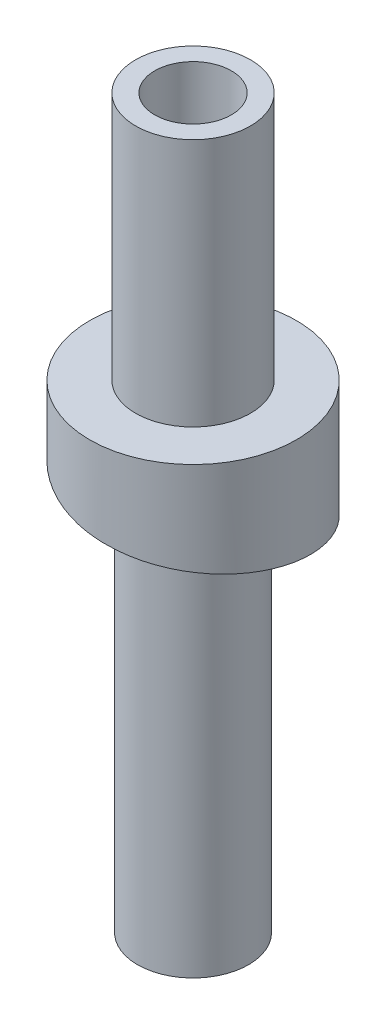
ISO-10303-21;
HEADER;
FILE_DESCRIPTION(('STEP AP214'),'2;1');
FILE_NAME('part.step','',(''),(''),'','','');
FILE_SCHEMA(('AUTOMOTIVE_DESIGN { 1 0 10303 214 1 1 1 1 }'));
ENDSEC;
DATA;
#1=APPLICATION_CONTEXT('core data for automotive mechanical design processes');
#2=APPLICATION_PROTOCOL_DEFINITION('international standard','automotive_design',2000,#1);
#3=PRODUCT_CONTEXT('',#1,'mechanical');
#4=PRODUCT('Part','Part','',(#3));
#5=PRODUCT_RELATED_PRODUCT_CATEGORY('part','',(#4));
#6=PRODUCT_DEFINITION_FORMATION('','',#4);
#7=PRODUCT_DEFINITION_CONTEXT('part definition',#1,'design');
#8=PRODUCT_DEFINITION('design','',#6,#7);
#9=PRODUCT_DEFINITION_SHAPE('','',#8);
#10=(LENGTH_UNIT() NAMED_UNIT(*) SI_UNIT(.MILLI.,.METRE.));
#11=(NAMED_UNIT(*) PLANE_ANGLE_UNIT() SI_UNIT($,.RADIAN.));
#12=(NAMED_UNIT(*) SI_UNIT($,.STERADIAN.) SOLID_ANGLE_UNIT());
#13=UNCERTAINTY_MEASURE_WITH_UNIT(LENGTH_MEASURE(1.E-05),#10,'distance_accuracy_value','');
#14=(GEOMETRIC_REPRESENTATION_CONTEXT(3) GLOBAL_UNCERTAINTY_ASSIGNED_CONTEXT((#13)) GLOBAL_UNIT_ASSIGNED_CONTEXT((#10,
#11,#12)) REPRESENTATION_CONTEXT('',''));
#15=CARTESIAN_POINT('',(0.,0.,0.));
#16=DIRECTION('',(0.,0.,1.));
#17=DIRECTION('',(1.,0.,0.));
#18=AXIS2_PLACEMENT_3D('',#15,#16,#17);
#19=CARTESIAN_POINT('',(0.,-15.,0.));
#20=DIRECTION('',(0.,1.,0.));
#21=DIRECTION('',(0.,0.,1.));
#22=AXIS2_PLACEMENT_3D('',#19,#20,#21);
#23=CYLINDRICAL_SURFACE('',#22,5.4);
#24=CARTESIAN_POINT('',(-5.3999999996698,0.999399656294112,-5.97172927971695E-05));
#25=CARTESIAN_POINT('',(-5.4000178265633,0.977174880598727,0.151209153566943));
#26=CARTESIAN_POINT('',(-5.39364798262599,0.954902395951935,0.30247096272042));
#27=CARTESIAN_POINT('',(-5.36825059865979,0.910318758196815,0.603916884615939));
#28=CARTESIAN_POINT('',(-5.34922354242759,0.888007606598963,0.75410103832744));
#29=CARTESIAN_POINT('',(-5.29863118682716,0.843403285011911,1.05232904959454));
#30=CARTESIAN_POINT('',(-5.26706679158125,0.821110113842201,1.2003730606875));
#31=CARTESIAN_POINT('',(-5.19161572368665,0.776594936032765,1.49331586811294));
#32=CARTESIAN_POINT('',(-5.14772922756754,0.754372928378146,1.6382147094719));
#33=CARTESIAN_POINT('',(-5.07290549269013,0.721163550072862,1.85239165138986));
#34=CARTESIAN_POINT('',(-5.04646341472458,0.71011371131382,1.92325951998803));
#35=CARTESIAN_POINT('',(-4.9906260729381,0.688059986822164,2.0638239525372));
#36=CARTESIAN_POINT('',(-4.96123100119192,0.677056098149198,2.13352059232592));
#37=CARTESIAN_POINT('',(-4.86869868174248,0.643916524194166,2.34064870091816));
#38=CARTESIAN_POINT('',(-4.80120563163447,0.621649153954608,2.47614324490382));
#39=CARTESIAN_POINT('',(-4.65510982056123,0.576964057495631,2.74095346384578));
#40=CARTESIAN_POINT('',(-4.57650716432326,0.55454633269546,2.87026919703267));
#41=CARTESIAN_POINT('',(-4.40873273585271,0.509649801227048,3.1218476189417));
#42=CARTESIAN_POINT('',(-4.31956095871279,0.48717099453045,3.24411030438901));
#43=CARTESIAN_POINT('',(-4.13126828516315,0.442284056013888,3.48073059267735));
#44=CARTESIAN_POINT('',(-4.03214737758371,0.419875924273298,3.59508818664323));
#45=CARTESIAN_POINT('',(-3.82463505027185,0.375281551232411,3.81510546010851));
#46=CARTESIAN_POINT('',(-3.7162436314366,0.35309530991064,3.92076514044967));
#47=CARTESIAN_POINT('',(-3.49098667727326,0.308632112503799,4.12260674435207));
#48=CARTESIAN_POINT('',(-3.37412113710374,0.286355156366908,4.21878866249839));
#49=CARTESIAN_POINT('',(-3.13273011409719,0.24180122021004,4.40100755289137));
#50=CARTESIAN_POINT('',(-3.00820462501768,0.219524240190059,4.48704451687022));
#51=CARTESIAN_POINT('',(-2.75237747072786,0.174974799384202,4.64836428176492));
#52=CARTESIAN_POINT('',(-2.62107580210514,0.152702338600607,4.72364707726498));
#53=CARTESIAN_POINT('',(-2.35259029823634,0.108228652265236,4.86293967312713));
#54=CARTESIAN_POINT('',(-2.21540646957201,0.086027426633782,4.92694948610251));
#55=CARTESIAN_POINT('',(-2.00599471370272,0.0527553630813829,5.01415088863303));
#56=CARTESIAN_POINT('',(-1.93557583178235,0.0416682641978849,5.04175201367388));
#57=CARTESIAN_POINT('',(-1.79365271458233,0.0194471748759414,5.09396968973677));
#58=CARTESIAN_POINT('',(-1.72214854931399,0.00831318749545727,5.11858643236739));
#59=CARTESIAN_POINT('',(-1.50618430723322,-0.0251250411916359,5.18789549355645));
#60=CARTESIAN_POINT('',(-1.36024694804092,-0.0474695945053216,5.22805727498569));
#61=CARTESIAN_POINT('',(-1.06554888430383,-0.0921971667774313,5.29598731725628));
#62=CARTESIAN_POINT('',(-0.916788216276869,-0.114580185234931,5.32375573828461));
#63=CARTESIAN_POINT('',(-0.61742864177302,-0.159312175059446,5.36671565600503));
#64=CARTESIAN_POINT('',(-0.466829698605207,-0.18166114573684,5.38190690124592));
#65=CARTESIAN_POINT('',(-0.24038624985808,-0.215081616971216,5.39517742403418));
#66=CARTESIAN_POINT('',(-0.164800307356206,-0.226206646848385,5.39801452009858));
#67=CARTESIAN_POINT('',(-0.0135931064530676,-0.248405492961114,5.40051203637954));
#68=CARTESIAN_POINT('',(0.0620281328402532,-0.259479324481026,5.40017347537621));
#69=CARTESIAN_POINT('',(0.288780116418368,-0.292763202031905,5.39439189011458));
#70=CARTESIAN_POINT('',(0.439807459179115,-0.315036842625113,5.38418345079553));
#71=CARTESIAN_POINT('',(0.740446606290323,-0.359639375373229,5.35113211704245));
#72=CARTESIAN_POINT('',(0.890058398208488,-0.381968268011229,5.32828911174796));
#73=CARTESIAN_POINT('',(1.18683785667422,-0.426638962847754,5.2701306736067));
#74=CARTESIAN_POINT('',(1.33400557354202,-0.448980764770671,5.23481549787933));
#75=CARTESIAN_POINT('',(1.62486751822482,-0.49360685215823,5.15195830474442));
#76=CARTESIAN_POINT('',(1.76856170416522,-0.515891136926594,5.10441614001671));
#77=CARTESIAN_POINT('',(2.05147327328545,-0.560311172543896,4.9974318479477));
#78=CARTESIAN_POINT('',(2.19069066035812,-0.582446923521979,4.93798973095448));
#79=CARTESIAN_POINT('',(2.46362390046559,-0.626893277562989,4.80764293034048));
#80=CARTESIAN_POINT('',(2.59733975975406,-0.649203880427123,4.73673825974982));
#81=CARTESIAN_POINT('',(2.85834145335515,-0.693868908275784,4.58396678338083));
#82=CARTESIAN_POINT('',(2.98562727768633,-0.71622333332828,4.50209996058652));
#83=CARTESIAN_POINT('',(3.23289611734722,-0.760929423847303,4.32796044608238));
#84=CARTESIAN_POINT('',(3.35287913338946,-0.783281089314098,4.23568775538785));
#85=CARTESIAN_POINT('',(3.52670818536571,-0.816738479300261,4.08999418983344));
#86=CARTESIAN_POINT('',(3.58363272098873,-0.827880446703786,4.04020986128661));
#87=CARTESIAN_POINT('',(3.69534943179368,-0.850121333308605,3.9382874169927));
#88=CARTESIAN_POINT('',(3.75014160644302,-0.861220252499146,3.88614930065773));
#89=CARTESIAN_POINT('',(3.85748943695835,-0.883400051975492,3.77961549533459));
#90=CARTESIAN_POINT('',(3.91004508950019,-0.894480932234462,3.72521980299123));
#91=CARTESIAN_POINT('',(4.01281835834331,-0.916688765831424,3.61427846234613));
#92=CARTESIAN_POINT('',(4.06303597534979,-0.927815719155517,3.55773281469287));
#93=CARTESIAN_POINT('',(4.21005277998158,-0.961228036054723,3.38501181881088));
#94=CARTESIAN_POINT('',(4.30323899226335,-0.983549609751789,3.26572951580854));
#95=CARTESIAN_POINT('',(4.47925604270588,-1.02822734700231,3.01979201869376));
#96=CARTESIAN_POINT('',(4.56208690229309,-1.05058351048409,2.89313683983748));
#97=CARTESIAN_POINT('',(4.71684250949853,-1.0952659819431,2.63329681768933));
#98=CARTESIAN_POINT('',(4.78876726959834,-1.11759228995447,2.50011198187061));
#99=CARTESIAN_POINT('',(4.88807424528647,-1.15098941062395,2.29618247074829));
#100=CARTESIAN_POINT('',(4.91974997215547,-1.1621077804496,2.22750506402456));
#101=CARTESIAN_POINT('',(4.98019091192907,-1.18429630481602,2.08887889616817));
#102=CARTESIAN_POINT('',(5.00895631404504,-1.19536646244641,2.01893021803499));
#103=CARTESIAN_POINT('',(5.09080154192666,-1.22864085424066,1.8073731892616));
#104=CARTESIAN_POINT('',(5.13944254511364,-1.25091303495146,1.66402887339639));
#105=CARTESIAN_POINT('',(5.22451615494095,-1.29552411776778,1.37379272497594));
#106=CARTESIAN_POINT('',(5.26094878421978,-1.31786301974949,1.22690089899956));
#107=CARTESIAN_POINT('',(5.32136164924338,-1.36255806902657,0.930575842431477));
#108=CARTESIAN_POINT('',(5.34534188258628,-1.38491421632527,0.781142611349594));
#109=CARTESIAN_POINT('',(5.38067983209711,-1.42957039391223,0.480783763740677));
#110=CARTESIAN_POINT('',(5.39203752662502,-1.45187042410422,0.329858144655548));
#111=CARTESIAN_POINT('',(5.40204654371675,-1.49630759316585,0.0275618931040903));
#112=CARTESIAN_POINT('',(5.40069787850004,-1.51844473219212,-0.123808738934139));
#113=CARTESIAN_POINT('',(5.38530439727206,-1.56288825847511,-0.42587745066101));
#114=CARTESIAN_POINT('',(5.37125959293327,-1.58519464557621,-0.57657553096785));
#115=CARTESIAN_POINT('',(5.33057564746259,-1.62985046209607,-0.876257042844943));
#116=CARTESIAN_POINT('',(5.30393648647819,-1.65219989158262,-1.02524047171201));
#117=CARTESIAN_POINT('',(5.23825370704394,-1.69689941002416,-1.3204419287004));
#118=CARTESIAN_POINT('',(5.19921009038711,-1.71924949897906,-1.46665995722145));
#119=CARTESIAN_POINT('',(5.10897802564143,-1.76384722768906,-1.75533597157626));
#120=CARTESIAN_POINT('',(5.05778959827772,-1.78609486761893,-1.89779396382607));
#121=CARTESIAN_POINT('',(4.97218611466268,-1.81936818000581,-2.10786357896696));
#122=CARTESIAN_POINT('',(4.94217718636069,-1.83044430159668,-2.17729232248492));
#123=CARTESIAN_POINT('',(4.87927629439493,-1.85264601633976,-2.31481759662624));
#124=CARTESIAN_POINT('',(4.84638451606671,-1.86377160626811,-2.38291421254696));
#125=CARTESIAN_POINT('',(4.74346268388456,-1.89718029855729,-2.5850364117898));
#126=CARTESIAN_POINT('',(4.669175689953,-1.91949936792724,-2.71691996369978));
#127=CARTESIAN_POINT('',(4.50981492986262,-1.96417451057228,-2.97396144440029));
#128=CARTESIAN_POINT('',(4.42474130017414,-1.98653058337568,-3.09911945825244));
#129=CARTESIAN_POINT('',(4.24437172319027,-2.03121468341123,-3.3418804165956));
#130=CARTESIAN_POINT('',(4.14907557113325,-2.05354271007256,-3.45948320967671));
#131=CARTESIAN_POINT('',(3.99899383505381,-2.08694769105999,-3.62956932633709));
#132=CARTESIAN_POINT('',(3.94776693104325,-2.0980702116176,-3.68522133615174));
#133=CARTESIAN_POINT('',(3.84303310379909,-2.12026194853953,-3.79431306233925));
#134=CARTESIAN_POINT('',(3.78952691730694,-2.13133118085996,-3.84775348272561));
#135=CARTESIAN_POINT('',(3.62570440662807,-2.16460486793246,-4.00463802328515));
#136=CARTESIAN_POINT('',(3.51207859131076,-2.18687652703594,-4.10465169946512));
#137=CARTESIAN_POINT('',(3.27685769130527,-2.23149118089353,-4.2947735279359));
#138=CARTESIAN_POINT('',(3.15526253884915,-2.25383417625271,-4.38488159597606));
#139=CARTESIAN_POINT('',(2.90494114817733,-2.29853704720246,-4.55457763106353));
#140=CARTESIAN_POINT('',(2.77621505628556,-2.32089692243738,-4.63416581386114));
#141=CARTESIAN_POINT('',(2.51253123787613,-2.36556225641265,-4.7822646476277));
#142=CARTESIAN_POINT('',(2.37757343562233,-2.38786771448818,-4.85077516392034));
#143=CARTESIAN_POINT('',(2.10236052238183,-2.43230583395117,-4.9762382039842));
#144=CARTESIAN_POINT('',(1.96210541671941,-2.45443849551228,-5.03319073937191));
#145=CARTESIAN_POINT('',(1.6773332056941,-2.4988625846576,-5.13511720805373));
#146=CARTESIAN_POINT('',(1.5328161032152,-2.52115401213438,-5.18009114945327));
#147=CARTESIAN_POINT('',(1.24052264536529,-2.56578061882385,-5.25775308131304));
#148=CARTESIAN_POINT('',(1.09274628502929,-2.58811579810314,-5.29044105305606));
#149=CARTESIAN_POINT('',(0.794977789833262,-2.63279023616514,-5.34330230557272));
#150=CARTESIAN_POINT('',(0.644985655672946,-2.65512949494657,-5.36347559029825));
#151=CARTESIAN_POINT('',(0.3438055675547,-2.69972200112572,-5.39116489264816));
#152=CARTESIAN_POINT('',(0.192617615539742,-2.7219752486631,-5.39868093083386));
#153=CARTESIAN_POINT('',(-0.0342158862432015,-2.75525955155555,-5.40042153547064));
#154=CARTESIAN_POINT('',(-0.10984507398113,-2.76633976549836,-5.39941210837226));
#155=CARTESIAN_POINT('',(-0.260981632808378,-2.7885525747553,-5.3942196971673));
#156=CARTESIAN_POINT('',(-0.336489011411347,-2.7996851666586,-5.39003691694137));
#157=CARTESIAN_POINT('',(-0.56264206882186,-2.83311942966856,-5.37273530254587));
#158=CARTESIAN_POINT('',(-0.712946339686217,-2.85546163456564,-5.35486340333707));
#159=CARTESIAN_POINT('',(-1.01149276598297,-2.90018770657342,-5.3065769201163));
#160=CARTESIAN_POINT('',(-1.15973494781799,-2.92257157314652,-5.27616249684964));
#161=CARTESIAN_POINT('',(-1.45317596678746,-2.96730659893997,-5.20299283895735));
#162=CARTESIAN_POINT('',(-1.59837474285935,-2.98965775749572,-5.16023735697585));
#163=CARTESIAN_POINT('',(-1.81308576505567,-3.02309070509243,-5.08708609666182));
#164=CARTESIAN_POINT('',(-1.88415439209606,-3.03422143146982,-5.06119373485494));
#165=CARTESIAN_POINT('',(-2.02512653653212,-3.05642600903295,-5.00645358823305));
#166=CARTESIAN_POINT('',(-2.09503042035921,-3.06749987731778,-4.97760675412426));
#167=CARTESIAN_POINT('',(-2.30284381295086,-3.10075669738933,-4.88669301214447));
#168=CARTESIAN_POINT('',(-2.43886305541148,-3.122976093146,-4.82025014042789));
#169=CARTESIAN_POINT('',(-2.70482454661856,-3.16745619742481,-4.67619539739648));
#170=CARTESIAN_POINT('',(-2.83476673620204,-3.18971690634697,-4.5985834173751));
#171=CARTESIAN_POINT('',(-3.08767935232394,-3.23426087223701,-4.43273056945183));
#172=CARTESIAN_POINT('',(-3.2106499217669,-3.25654412873318,-4.34448991953276));
#173=CARTESIAN_POINT('',(-3.44875422423941,-3.30110415316672,-4.15800009341119));
#174=CARTESIAN_POINT('',(-3.56388785918166,-3.32338092101939,-4.05975079197855));
#175=CARTESIAN_POINT('',(-3.78551131662821,-3.36785792138323,-3.85392924675164));
#176=CARTESIAN_POINT('',(-3.89200117924987,-3.39005815424914,-3.74635704623149));
#177=CARTESIAN_POINT('',(-4.09555771700039,-3.43467527583744,-3.52268022694963));
#178=CARTESIAN_POINT('',(-4.1926244640092,-3.45709216290574,-3.40657567328498));
#179=CARTESIAN_POINT('',(-4.37667008798019,-3.50197764999186,-3.16664202290592));
#180=CARTESIAN_POINT('',(-4.4636488048156,-3.52444625082475,-3.04281280362627));
#181=CARTESIAN_POINT('',(-4.62692405226373,-3.56933725467068,-2.78826643866311));
#182=CARTESIAN_POINT('',(-4.7032203861457,-3.59175965682541,-2.65754916618764));
#183=CARTESIAN_POINT('',(-4.80922852067601,-3.625248177439,-2.45703958535307));
#184=CARTESIAN_POINT('',(-4.84316093922107,-3.63638774406675,-2.38945839355842));
#185=CARTESIAN_POINT('',(-4.90816488711454,-3.65859515511169,-2.25291649745004));
#186=CARTESIAN_POINT('',(-4.93923640416109,-3.66966299922028,-2.18395578720592));
#187=CARTESIAN_POINT('',(-4.99845574764461,-3.69173073934433,-2.04478808018313));
#188=CARTESIAN_POINT('',(-5.02660385051284,-3.70273064169153,-1.97458120197561));
#189=CARTESIAN_POINT('',(-5.07992255326128,-3.72478993262735,-1.83305901868134));
#190=CARTESIAN_POINT('',(-5.10509320227857,-3.73584932023113,-1.7617437319087));
#191=CARTESIAN_POINT('',(-5.17608029696566,-3.76907041215848,-1.54630513551969));
#192=CARTESIAN_POINT('',(-5.21737500340102,-3.79127620049047,-1.40068177011272));
#193=CARTESIAN_POINT('',(-5.30139986763135,-3.84454046807698,-1.04858070854727));
#194=CARTESIAN_POINT('',(-5.33831286434336,-3.87564745931957,-0.840684463151389));
#195=CARTESIAN_POINT('',(-5.37529247344344,-3.92230673056301,-0.52667513971064));
#196=CARTESIAN_POINT('',(-5.38455405847756,-3.93787203308347,-0.421559831101073));
#197=CARTESIAN_POINT('',(-5.39690692962542,-3.96896780702359,-0.21097393413955));
#198=CARTESIAN_POINT('',(-5.3999988929973,-3.98449828207941,-0.105503386056668));
#199=CARTESIAN_POINT('',(-5.4,-3.99999999999999,0.));
#200=B_SPLINE_CURVE_WITH_KNOTS('',3,(#24,#25,#26,#27,#28,#29,#30,#31,#32,#33,#34,#35,#36,#37,
#38,#39,#40,#41,#42,#43,#44,#45,#46,#47,#48,#49,#50,#51,#52,#53,#54,#55,#56,#57,#58,#59,#60,#61,
#62,#63,#64,#65,#66,#67,#68,#69,#70,#71,#72,#73,#74,#75,#76,#77,#78,#79,#80,#81,#82,#83,#84,#85,
#86,#87,#88,#89,#90,#91,#92,#93,#94,#95,#96,#97,#98,#99,#100,#101,#102,#103,#104,#105,#106,#107,
#108,#109,#110,#111,#112,#113,#114,#115,#116,#117,#118,#119,#120,#121,#122,#123,#124,#125,#126,
#127,#128,#129,#130,#131,#132,#133,#134,#135,#136,#137,#138,#139,#140,#141,#142,#143,#144,#145,
#146,#147,#148,#149,#150,#151,#152,#153,#154,#155,#156,#157,#158,#159,#160,#161,#162,#163,#164,
#165,#166,#167,#168,#169,#170,#171,#172,#173,#174,#175,#176,#177,#178,#179,#180,#181,#182,#183,
#184,#185,#186,#187,#188,#189,#190,#191,#192,#193,#194,#195,#196,#197,#198,#199),.UNSPECIFIED.,
.F.,.F.,(4,2,2,2,2,2,2,2,2,2,2,2,2,2,2,2,2,2,2,2,2,2,2,2,2,2,2,2,2,2,2,2,2,2,2,2,2,2,2,2,2,2,2,
2,2,2,2,2,2,2,2,2,2,2,2,2,2,2,2,2,2,2,2,2,2,2,2,2,2,2,2,2,2,2,2,2,2,2,2,2,2,2,2,2,2,2,2,4),(0.,
0.458546890683472,0.917076255333475,1.3755725594285,1.83406229532291,2.06333435367815,
2.29259150888757,2.75102617466047,3.2094565191824,3.6678870765589,4.12631814861377,
4.58474917630283,5.04318046590514,5.50161212911132,5.96004402318167,6.41847540431069,
6.64774798480484,6.8770058373318,7.3354379402431,7.79386411764402,8.25229945998209,
8.48160150521085,8.71082999074289,9.16926173739217,9.62769750655904,10.0861238254182,
10.5445556680091,11.0029871119542,11.4614180347792,11.9198496692113,12.3782812589141,
12.6075461357008,12.83681106975,13.0660763445441,13.2953415501876,13.7537737044201,
14.2122049100867,14.6706355910942,14.8999083593506,15.1291662121128,15.5875979916821,
16.0460289211572,16.5044599390564,16.9628917428864,17.4213231058517,17.8797540473483,
18.3381857114732,18.7966173093337,19.2550481248852,19.484320733282,19.7135786127674,
20.1720107588192,20.6304371054585,21.0888726362955,21.3181747259186,21.5474032515275,
22.0058350038924,22.464270655077,22.9226969028333,23.3811287234702,23.8395600833525,
24.2979911330323,24.7564228811112,25.2148544844265,25.6732853430323,25.9025579035031,
26.1318157349852,26.5902477623576,27.0486739146357,27.5071092559371,27.7364114412035,
27.9656400708139,28.4240718109068,28.8825080131202,29.3409348148905,29.7993673532889,
30.2577977638946,30.7162246772971,31.1746588662901,31.6331014968681,31.8623603874077,
32.0916202637136,32.3208584419636,32.5500928365561,33.0085375917984,33.6472008912826,
33.9670431747902,34.2868503463059),.UNSPECIFIED.);
#201=CARTESIAN_POINT('',(-5.40000000386535,0.999385742855487,-2.9858646389002E-05));
#202=VERTEX_POINT('',#201);
#203=CARTESIAN_POINT('',(-5.4,-3.99999999999999,0.));
#204=VERTEX_POINT('',#203);
#205=EDGE_CURVE('E79',#202,#204,#200,.T.);
#206=ORIENTED_EDGE('',*,*,#205,.T.);
#207=DIRECTION('',(0.,1.,0.));
#208=VECTOR('',#207,1.);
#209=CARTESIAN_POINT('',(-5.4,-15.,0.));
#210=LINE('',#209,#208);
#211=EDGE_CURVE('E60',#202,#204,#210,.F.);
#212=ORIENTED_EDGE('',*,*,#211,.F.);
#213=EDGE_LOOP('',(#206,#212));
#214=FACE_BOUND('',#213,.T.);
#215=CARTESIAN_POINT('',(0.,4.00000000000001,0.));
#216=DIRECTION('',(0.,1.,0.));
#217=DIRECTION('',(0.,0.,1.));
#218=AXIS2_PLACEMENT_3D('',#215,#216,#217);
#219=CIRCLE('',#218,5.4);
#220=CARTESIAN_POINT('',(0.,4.00000000000001,5.4));
#221=VERTEX_POINT('',#220);
#222=EDGE_CURVE('E136',#221,#221,#219,.F.);
#223=ORIENTED_EDGE('',*,*,#222,.T.);
#224=EDGE_LOOP('',(#223));
#225=FACE_BOUND('',#224,.T.);
#226=ADVANCED_FACE('F37',(#214,#225),#23,.T.);
#227=CARTESIAN_POINT('',(0.,0.,0.));
#228=DIRECTION('',(0.,0.,1.));
#229=DIRECTION('',(1.,0.,0.));
#230=AXIS2_PLACEMENT_3D('',#227,#228,#229);
#231=PLANE('',#230);
#232=DIRECTION('',(0.,1.,0.));
#233=VECTOR('',#232,1.);
#234=CARTESIAN_POINT('',(-2.9,-21.,0.));
#235=LINE('',#234,#233);
#236=CARTESIAN_POINT('',(-2.9000000033907,0.998795213985208,-5.85637856939133E-05));
#237=VERTEX_POINT('',#236);
#238=CARTESIAN_POINT('',(-2.9,-3.99999999999999,0.));
#239=VERTEX_POINT('',#238);
#240=EDGE_CURVE('E53',#237,#239,#235,.F.);
#241=ORIENTED_EDGE('',*,*,#240,.F.);
#242=DIRECTION('',(0.999999973088057,-0.000230860421766002,-2.29641107918761E-05));
#243=VECTOR('',#242,1.);
#244=CARTESIAN_POINT('',(-8.00092344168706,1.00000010659308,1.06028938962078E-08));
#245=LINE('',#244,#243);
#246=EDGE_CURVE('E46',#202,#237,#245,.T.);
#247=ORIENTED_EDGE('',*,*,#246,.F.);
#248=ORIENTED_EDGE('',*,*,#211,.T.);
#249=DIRECTION('',(1.,0.,0.));
#250=VECTOR('',#249,1.);
#251=CARTESIAN_POINT('',(-8.,-3.99999999999999,0.));
#252=LINE('',#251,#250);
#253=EDGE_CURVE('E77',#204,#239,#252,.T.);
#254=ORIENTED_EDGE('',*,*,#253,.T.);
#255=EDGE_LOOP('',(#241,#247,#248,#254));
#256=FACE_BOUND('',#255,.T.);
#257=ADVANCED_FACE('F75',(#256),#231,.T.);
#258=CARTESIAN_POINT('',(-8.,-3.99999999999999,0.));
#259=CARTESIAN_POINT('',(-8.00257375854974,-3.89338735715686,-1.07185065232555));
#260=CARTESIAN_POINT('',(-7.78373453650469,-3.79035774594098,-2.10529392517088));
#261=CARTESIAN_POINT('',(-6.99401880020084,-3.58316138615907,-4.03221228656934));
#262=CARTESIAN_POINT('',(-6.39646861214662,-3.47913413812738,-4.91587174319132));
#263=CARTESIAN_POINT('',(-4.91377088176032,-3.27035639836759,-6.4016049056365));
#264=CARTESIAN_POINT('',(-4.02347255561917,-3.16615531739926,-6.99113552317075));
#265=CARTESIAN_POINT('',(-2.09538967076484,-2.95836609494912,-7.79410612069808));
#266=CARTESIAN_POINT('',(-1.05699226712167,-2.8551496709309,-7.99848992938313));
#267=CARTESIAN_POINT('',(1.0471509978436,-2.64583725427085,-8.00221650739011));
#268=CARTESIAN_POINT('',(2.09256861004922,-2.54177146188445,-7.79072120900569));
#269=CARTESIAN_POINT('',(4.03086096640402,-2.33322790760887,-6.99222870121112));
#270=CARTESIAN_POINT('',(4.91538904676814,-2.2291668054374,-6.39616963764871));
#271=CARTESIAN_POINT('',(6.39902454571476,-2.02083347344965,-4.91810312787881));
#272=CARTESIAN_POINT('',(6.98854001182685,-1.91677055582537,-4.02920898309485));
#273=CARTESIAN_POINT('',(7.79443385999977,-1.7082292960165,-2.09398239397787));
#274=CARTESIAN_POINT('',(7.99848313423267,-1.60416678564359,-1.04706493843214));
#275=CARTESIAN_POINT('',(8.00244030746065,-1.39583316036398,1.04717045668043));
#276=CARTESIAN_POINT('',(7.79071900162392,-1.291770646282,2.09255952548582));
#277=CARTESIAN_POINT('',(6.99215918211795,-1.08322939384344,4.03082397272763));
#278=CARTESIAN_POINT('',(6.39618315768947,-0.979166485279342,4.91540726745903));
#279=CARTESIAN_POINT('',(4.9181215041865,-0.770833127833457,6.39904759614231));
#280=CARTESIAN_POINT('',(4.02918474645653,-0.666771999472267,6.98848378584361));
#281=CARTESIAN_POINT('',(2.0939728042437,-0.458228522041629,7.79441328471571));
#282=CARTESIAN_POINT('',(1.04707061348181,-0.354162783581354,7.99863982404653));
#283=CARTESIAN_POINT('',(-1.05707236179549,-0.144850177956269,8.00250125844548));
#284=CARTESIAN_POINT('',(-2.09384263031032,-0.041633617816496,7.78993705110424));
#285=CARTESIAN_POINT('',(-4.02498541971468,0.166155165058766,6.994353506172));
#286=CARTESIAN_POINT('',(-4.91230691070852,0.270356234476994,6.40014648716209));
#287=CARTESIAN_POINT('',(-6.39893035563215,0.479134471688495,4.91834163580414));
#288=CARTESIAN_POINT('',(-6.98770190260526,0.583161941534001,4.02934811841565));
#289=CARTESIAN_POINT('',(-7.78902626686691,0.790357356721358,2.10722813397379));
#290=CARTESIAN_POINT('',(-7.99835202853595,0.893484530796071,1.07086875271416));
#291=CARTESIAN_POINT('',(-8.00092344168706,1.00000010659308,1.06028938962078E-08));
#292=CARTESIAN_POINT('',(-5.33333333333333,-3.99999999999999,0.));
#293=CARTESIAN_POINT('',(-5.33591052726501,-3.89496331769898,-0.706445256298375));
#294=CARTESIAN_POINT('',(-5.18578167742082,-3.78877891117671,-1.40965481043492));
#295=CARTESIAN_POINT('',(-4.66520084942879,-3.58579023086153,-2.68545011400052));
#296=CARTESIAN_POINT('',(-4.2619587912905,-3.47827975795936,-3.27899701177204));
#297=CARTESIAN_POINT('',(-3.27944615688745,-3.27135282038255,-4.26484294926907));
#298=CARTESIAN_POINT('',(-2.67744423472326,-3.16527181857371,-4.66230667430747));
#299=CARTESIAN_POINT('',(-1.40131323223008,-2.96016249726486,-5.19521572551673));
#300=CARTESIAN_POINT('',(-0.700314119264703,-2.85411679744041,-5.33181493990718));
#301=CARTESIAN_POINT('',(0.693698398277523,-2.64734084129614,-5.3355581085609));
#302=CARTESIAN_POINT('',(1.39905748703996,-2.54075803220873,-5.19161136326928));
#303=CARTESIAN_POINT('',(2.68349239156562,-2.33490793594773,-4.66394024165419));
#304=CARTESIAN_POINT('',(3.27974048676965,-2.22814768490279,-4.26058660859903));
#305=CARTESIAN_POINT('',(4.26347368246178,-2.02245097537456,-3.28241329535333));
#306=CARTESIAN_POINT('',(4.66028510863292,-1.91575306512231,-2.68178831541048));
#307=CARTESIAN_POINT('',(5.1953553116821,-1.70986737457024,-1.40036677660258));
#308=CARTESIAN_POINT('',(5.33182039199102,-1.60315087899433,-0.693548565748473));
#309=CARTESIAN_POINT('',(5.33576975225155,-1.39746469400098,0.693715329746353));
#310=CARTESIAN_POINT('',(5.19162423985377,-1.29074819471151,1.39900348432948));
#311=CARTESIAN_POINT('',(4.66387361572804,-1.08486251151514,2.68345689598049));
#312=CARTESIAN_POINT('',(4.26059451417979,-0.978164610344443,3.27976626893928));
#313=CARTESIAN_POINT('',(3.2824241131271,-0.772467875393662,4.26350235033756));
#314=CARTESIAN_POINT('',(2.68176257590257,-0.6657075981196,4.66022597984028));
#315=CARTESIAN_POINT('',(1.4004021032319,-0.459857578552958,5.19531964964743));
#316=CARTESIAN_POINT('',(0.693556770380385,-0.353274823543125,5.33198926740781));
#317=CARTESIAN_POINT('',(-0.700455458014373,-0.14649867882354,5.33581838756105));
#318=CARTESIAN_POINT('',(-1.39982575412127,-0.040452842452305,5.19103039693448));
#319=CARTESIAN_POINT('',(-2.67901069507497,0.16465604013904,4.6654939952144));
#320=CARTESIAN_POINT('',(-3.27803114244664,0.270737029374638,4.26334688831456));
#321=CARTESIAN_POINT('',(-4.264458314153,0.477664462984595,3.28141807776119));
#322=CARTESIAN_POINT('',(-4.65891439354285,0.58517515963663,2.68253224654766));
#323=CARTESIAN_POINT('',(-5.1910897904139,0.788162896541674,1.41152950859775));
#324=CARTESIAN_POINT('',(-5.33169124293866,0.894493097485007,0.705402728845744));
#325=CARTESIAN_POINT('',(-5.33425684678557,0.9993844788017,-6.12270258844402E-05));
#326=CARTESIAN_POINT('',(-2.66666666666667,-3.99999999999999,0.));
#327=CARTESIAN_POINT('',(-2.66925421962203,-3.89626628936185,-0.340975162473052));
#328=CARTESIAN_POINT('',(-2.58782881833674,-3.78720007641199,-0.714015695699179));
#329=CARTESIAN_POINT('',(-2.33638289865697,-3.58841907556444,-1.33868794143147));
#330=CARTESIAN_POINT('',(-2.12744897043428,-3.47742537779179,-1.64212228035266));
#331=CARTESIAN_POINT('',(-1.6451214320147,-3.27234924239705,-2.12808099290177));
#332=CARTESIAN_POINT('',(-1.3314159138277,-3.16438831974726,-2.33347782544353));
#333=CARTESIAN_POINT('',(-0.707236793694976,-2.96195889958151,-2.59632533033607));
#334=CARTESIAN_POINT('',(-0.34363597140774,-2.85308392395038,-2.66513995043078));
#335=CARTESIAN_POINT('',(0.340245798711451,-2.64884442832098,-2.66889970973216));
#336=CARTESIAN_POINT('',(0.705546364030924,-2.53974460253391,-2.59250151753244));
#337=CARTESIAN_POINT('',(1.33612381672699,-2.33658796428568,-2.33565178209773));
#338=CARTESIAN_POINT('',(1.64409192677118,-2.22712856436726,-2.12500357954914));
#339=CARTESIAN_POINT('',(2.12792281920881,-2.02406847730038,-1.64672346282809));
#340=CARTESIAN_POINT('',(2.33203020543923,-1.91473557441834,-1.33436764772578));
#341=CARTESIAN_POINT('',(2.59627676336422,-1.71150545312489,-0.706751159227639));
#342=CARTESIAN_POINT('',(2.66515764974984,-1.60213497234461,-0.340032193064807));
#343=CARTESIAN_POINT('',(2.669099197042,-1.39909622763844,0.340260202812277));
#344=CARTESIAN_POINT('',(2.59252947808363,-1.28972574314148,0.705447443172813));
#345=CARTESIAN_POINT('',(2.33558804933814,-1.08649562918638,1.33608981923371));
#346=CARTESIAN_POINT('',(2.12500587067025,-0.977162735409087,1.64412527041944));
#347=CARTESIAN_POINT('',(1.6467267220676,-0.774102622954323,2.12795710453294));
#348=CARTESIAN_POINT('',(1.33434040534873,-0.664643196766477,2.33196817383718));
#349=CARTESIAN_POINT('',(0.706831402219997,-0.461486635064742,2.59622601457894));
#350=CARTESIAN_POINT('',(0.340042927278965,-0.352386863504898,2.66533871076934));
#351=CARTESIAN_POINT('',(-0.343838554233255,-0.148147179690813,2.66913551667642));
#352=CARTESIAN_POINT('',(-0.705808877932562,-0.0392720670876604,2.59212374276543));
#353=CARTESIAN_POINT('',(-1.33303597043492,0.163156915218864,2.33663448425614));
#354=CARTESIAN_POINT('',(-1.64375537418534,0.271117824271826,2.12654728946647));
#355=CARTESIAN_POINT('',(-2.1299862726733,0.476194454281146,1.64449451971881));
#356=CARTESIAN_POINT('',(-2.33012688448113,0.587188377740169,1.33571637468002));
#357=CARTESIAN_POINT('',(-2.59315331396024,0.785968436361093,0.715830883221382));
#358=CARTESIAN_POINT('',(-2.66502598836156,0.89532377199335,0.339901947055013));
#359=CARTESIAN_POINT('',(-2.66759025188409,0.998768851010324,-0.000122464654662776));
#360=CARTESIAN_POINT('',(0.,-3.99999999999999,0.));
#361=CARTESIAN_POINT('',(-0.002570177620338,-3.89867643555635,0.0271500222445158));
#362=CARTESIAN_POINT('',(0.0101240407471483,-3.78562124164773,-0.0183765809634383));
#363=CARTESIAN_POINT('',(-0.00756494788492863,-3.5910479202669,0.00807423113758066));
#364=CARTESIAN_POINT('',(0.00706085042198035,-3.47657099762376,-0.00524754893338527));
#365=CARTESIAN_POINT('',(-0.0107967071419711,-3.27334566441201,0.00868096346565587));
#366=CARTESIAN_POINT('',(0.0146124070681834,-3.16350482092126,-0.00464897657980627));
#367=CARTESIAN_POINT('',(-0.0131603551601811,-2.9637553018977,0.00256506484483423));
#368=CARTESIAN_POINT('',(0.0130421764492249,-2.85205105045989,0.00153503904555977));
#369=CARTESIAN_POINT('',(-0.0132068008546223,-2.65034801534628,-0.00224131090333778));
#370=CARTESIAN_POINT('',(0.0120352410217299,-2.53873117285819,0.00660832820400937));
#371=CARTESIAN_POINT('',(-0.0112447581114778,-2.33826799262455,-0.00736332254083798));
#372=CARTESIAN_POINT('',(0.00844336677284193,-2.22610944383265,0.0105794495008468));
#373=CARTESIAN_POINT('',(-0.00762804404432931,-2.02568597922528,-0.0110336303029071));
#374=CARTESIAN_POINT('',(0.00377530224539696,-1.91371808371483,0.0130530199586004));
#375=CARTESIAN_POINT('',(-0.00280178495354843,-1.71314353167908,-0.0131355418523559));
#376=CARTESIAN_POINT('',(-0.00150509249094695,-1.60111906569535,0.0134841796188632));
#377=CARTESIAN_POINT('',(0.00242864183203663,-1.40072776127544,-0.013194924121801));
#378=CARTESIAN_POINT('',(-0.00656528368654844,-1.28870329157099,0.0118914020162931));
#379=CARTESIAN_POINT('',(0.00730248294825923,-1.08812874685808,-0.0112772575132323));
#380=CARTESIAN_POINT('',(-0.0105827728393602,-0.976160860473731,0.00848427189974555));
#381=CARTESIAN_POINT('',(0.0110293310081314,-0.775737370514985,-0.00758814127187185));
#382=CARTESIAN_POINT('',(-0.0130817652051213,-0.66357879541381,0.00371036783370584));
#383=CARTESIAN_POINT('',(0.0132607012080932,-0.46311569157607,-0.00286762048920288));
#384=CARTESIAN_POINT('',(-0.013470915822458,-0.351498903466669,-0.00131184586912048));
#385=CARTESIAN_POINT('',(0.0127783495478658,-0.149795680558084,0.00245264579174011));
#386=CARTESIAN_POINT('',(-0.0117920017438856,-0.0380912917234693,-0.0067829114043219));
#387=CARTESIAN_POINT('',(0.0129387542051711,0.161657790299138,0.00777497329853442));
#388=CARTESIAN_POINT('',(-0.00947960592399169,0.271498619169015,-0.0102523093815502));
#389=CARTESIAN_POINT('',(0.00448576880637267,0.474724445577699,0.00757096167635859));
#390=CARTESIAN_POINT('',(-0.00133937541856918,0.589201595842798,-0.0110994971876914));
#391=CARTESIAN_POINT('',(0.00478316249261777,0.783773976181409,0.0201322578450753));
#392=CARTESIAN_POINT('',(0.00162320044902503,0.896801077887112,-0.0273412842651407));
#393=CARTESIAN_POINT('',(-0.000923656982600613,0.998153223218948,-0.000183702283441112));
#394=B_SPLINE_SURFACE_WITH_KNOTS('',3,3,((#258,#259,#260,#261,#262,#263,#264,#265,#266,#267,
#268,#269,#270,#271,#272,#273,#274,#275,#276,#277,#278,#279,#280,#281,#282,#283,#284,#285,#286,
#287,#288,#289,#290,#291),(#292,#293,#294,#295,#296,#297,#298,#299,#300,#301,#302,#303,#304,
#305,#306,#307,#308,#309,#310,#311,#312,#313,#314,#315,#316,#317,#318,#319,#320,#321,#322,#323,
#324,#325),(#326,#327,#328,#329,#330,#331,#332,#333,#334,#335,#336,#337,#338,#339,#340,#341,
#342,#343,#344,#345,#346,#347,#348,#349,#350,#351,#352,#353,#354,#355,#356,#357,#358,#359),
(#360,#361,#362,#363,#364,#365,#366,#367,#368,#369,#370,#371,#372,#373,#374,#375,#376,#377,#378,
#379,#380,#381,#382,#383,#384,#385,#386,#387,#388,#389,#390,#391,#392,#393)),.UNSPECIFIED.,.F.,
.F.,.F.,(4,4),(4,2,2,2,2,2,2,2,2,2,2,2,2,2,2,2,4),(0.,1.),(0.,0.0616094626067231,
0.124105841263246,0.186907974190017,0.25,0.312499830015683,0.375,0.437499972042991,0.5,
0.562500027957009,0.625,0.687500169984318,0.75,0.813092025809983,0.875894158736754,
0.938390537393277,1.),.UNSPECIFIED.);
#395=CARTESIAN_POINT('',(-2.89999999763468,0.998822505223695,-0.000117127571368617));
#396=CARTESIAN_POINT('',(-2.90002713168785,0.971809866567432,0.0969228013255993));
#397=CARTESIAN_POINT('',(-2.8951383715438,0.945030530982685,0.194036123126929));
#398=CARTESIAN_POINT('',(-2.87565179107144,0.891784621457423,0.387325152530403));
#399=CARTESIAN_POINT('',(-2.86105816726118,0.865317917363031,0.483501247171731));
#400=CARTESIAN_POINT('',(-2.82505645843683,0.816295023113796,0.660303685606916));
#401=CARTESIAN_POINT('',(-2.80492111329622,0.793720796123862,0.74118710538075));
#402=CARTESIAN_POINT('',(-2.75776247693014,0.748583042408289,0.900930818486468));
#403=CARTESIAN_POINT('',(-2.73073978034343,0.726019514927284,0.979791285828987));
#404=CARTESIAN_POINT('',(-2.68519920512779,0.69218353465076,1.09610246705051));
#405=CARTESIAN_POINT('',(-2.66918207991179,0.680904897505982,1.13454802017427));
#406=CARTESIAN_POINT('',(-2.63552073824565,0.658248817710119,1.21068715169118));
#407=CARTESIAN_POINT('',(-2.61787662997754,0.64687138167391,1.2483807798792));
#408=CARTESIAN_POINT('',(-2.56254654971067,0.612636568091204,1.36024765466927));
#409=CARTESIAN_POINT('',(-2.52245833950546,0.589673369862688,1.43321833178416));
#410=CARTESIAN_POINT('',(-2.436195102408,0.543596233678721,1.57539530952565));
#411=CARTESIAN_POINT('',(-2.39002038191038,0.52048230336675,1.64460179939367));
#412=CARTESIAN_POINT('',(-2.29189352633565,0.4742274050753,1.77880033239989));
#413=CARTESIAN_POINT('',(-2.23994130750389,0.451086436708671,1.84379231442002));
#414=CARTESIAN_POINT('',(-2.15796119191668,0.416484435763442,1.93776515424254));
#415=CARTESIAN_POINT('',(-2.12995359830032,0.404966543706406,1.96850897372883));
#416=CARTESIAN_POINT('',(-2.07263649648625,0.382009248859966,2.02876966250279));
#417=CARTESIAN_POINT('',(-2.04332738349454,0.370569823445846,2.05828689904295));
#418=CARTESIAN_POINT('',(-1.9535162395669,0.336307830889795,2.14492236594321));
#419=CARTESIAN_POINT('',(-1.89112676780144,0.313540023389558,2.2001285209103));
#420=CARTESIAN_POINT('',(-1.76183092902666,0.268089761682845,2.30496859953725));
#421=CARTESIAN_POINT('',(-1.69492522867669,0.245407295398399,2.35460334274851));
#422=CARTESIAN_POINT('',(-1.55706814802641,0.200039021085222,2.44795213095369));
#423=CARTESIAN_POINT('',(-1.48611550127672,0.177353214250952,2.49166430793696));
#424=CARTESIAN_POINT('',(-1.34074042138192,0.131924628448011,2.57280857604447));
#425=CARTESIAN_POINT('',(-1.26631855805439,0.109181859411986,2.61024169388985));
#426=CARTESIAN_POINT('',(-1.11455480183002,0.0636043796904019,2.6785617666642));
#427=CARTESIAN_POINT('',(-1.03721288996094,0.0407696684083336,2.70944867905231));
#428=CARTESIAN_POINT('',(-0.880169357614929,-0.00493048216396868,2.76445717661346));
#429=CARTESIAN_POINT('',(-0.800467761551398,-0.0277959211339577,2.78857883175316));
#430=CARTESIAN_POINT('',(-0.6392939849609,-0.0735557712157503,2.82988057570734));
#431=CARTESIAN_POINT('',(-0.557821802030629,-0.0964501823668396,2.84706065509907));
#432=CARTESIAN_POINT('',(-0.39370695458658,-0.142257073510733,2.87435464404941));
#433=CARTESIAN_POINT('',(-0.311064290764302,-0.165169553492855,2.88446855778243));
#434=CARTESIAN_POINT('',(-0.145200412741763,-0.21093337908451,2.89755725678571));
#435=CARTESIAN_POINT('',(-0.0619791994502303,-0.233784724789989,2.90053205326686));
#436=CARTESIAN_POINT('',(0.104431800716899,-0.279435015135985,2.89931258056675));
#437=CARTESIAN_POINT('',(0.187621587448478,-0.302233959538739,2.89511827892078));
#438=CARTESIAN_POINT('',(0.353308089299129,-0.347837520357598,2.87960206797315));
#439=CARTESIAN_POINT('',(0.435804803901279,-0.370642136777921,2.86828015335587));
#440=CARTESIAN_POINT('',(0.68134612362628,-0.439082077430522,2.8237158960957));
#441=CARTESIAN_POINT('',(0.842587277241172,-0.484782704530889,2.7798738262778));
#442=CARTESIAN_POINT('',(1.15509699098922,-0.576052125491212,2.66523935569539));
#443=CARTESIAN_POINT('',(1.30636554772589,-0.621620919306263,2.5944469457521));
#444=CARTESIAN_POINT('',(1.59458366112265,-0.712961579641324,2.42795225063085));
#445=CARTESIAN_POINT('',(1.73153323955422,-0.75873344585246,2.33225000332814));
#446=CARTESIAN_POINT('',(1.92304328431612,-0.827277428341506,2.17229369016902));
#447=CARTESIAN_POINT('',(1.98458443272892,-0.85011627205593,2.11621338371797));
#448=CARTESIAN_POINT('',(2.10264632691687,-0.89574886383172,1.99894696764538));
#449=CARTESIAN_POINT('',(2.15916707851838,-0.918542611945391,1.93776086394947));
#450=CARTESIAN_POINT('',(2.26672734531613,-0.964165794772129,1.81076665350049));
#451=CARTESIAN_POINT('',(2.31776685509674,-0.986995229520433,1.74495854218085));
#452=CARTESIAN_POINT('',(2.41399890356871,-1.03266712520577,1.60920197948995));
#453=CARTESIAN_POINT('',(2.4591914460477,-1.05550958613435,1.53925353080082));
#454=CARTESIAN_POINT('',(2.54339473380871,-1.10121595013832,1.3957305429391));
#455=CARTESIAN_POINT('',(2.58240547428895,-1.12407985323035,1.32215600094997));
#456=CARTESIAN_POINT('',(2.65396129231954,-1.16973757218462,1.17192962018157));
#457=CARTESIAN_POINT('',(2.68650637973376,-1.19253138815373,1.09527778609716));
#458=CARTESIAN_POINT('',(2.77404068422329,-1.26093070271069,0.861578160287468));
#459=CARTESIAN_POINT('',(2.81900215616846,-1.30659315257871,0.700661142743194));
#460=CARTESIAN_POINT('',(2.8806574794864,-1.39801408046789,0.373526940263347));
#461=CARTESIAN_POINT('',(2.8973513665113,-1.44377255836786,0.207309762012805));
#462=CARTESIAN_POINT('',(2.90089036330868,-1.51220382329419,-0.0422119241645003));
#463=CARTESIAN_POINT('',(2.89848070952864,-1.53498961275281,-0.125454393820131));
#464=CARTESIAN_POINT('',(2.88651760781792,-1.58060609216868,-0.291432243397096));
#465=CARTESIAN_POINT('',(2.87696415580831,-1.60343678215156,-0.374167623028865));
#466=CARTESIAN_POINT('',(2.8507798045365,-1.64910860392055,-0.53849284243625));
#467=CARTESIAN_POINT('',(2.83415005974751,-1.67194973339656,-0.620082866830736));
#468=CARTESIAN_POINT('',(2.79394590053125,-1.71765516121121,-0.78153615013795));
#469=CARTESIAN_POINT('',(2.77036925076374,-1.74051946464304,-0.861398844346577));
#470=CARTESIAN_POINT('',(2.68945859897666,-1.8090182741977,-1.09746043254981));
#471=CARTESIAN_POINT('',(2.62191664520095,-1.85460545336457,-1.2503027364697));
#472=CARTESIAN_POINT('',(2.46163109594034,-1.94590413652724,-1.54210525011315));
#473=CARTESIAN_POINT('',(2.36888751193947,-1.99161564046638,-1.68106546616255));
#474=CARTESIAN_POINT('',(2.21308075352127,-2.06015145548632,-1.87595898274011));
#475=CARTESIAN_POINT('',(2.15833609082569,-2.0830013217624,-1.93868978306557));
#476=CARTESIAN_POINT('',(2.04363285170672,-2.12864353955654,-2.05924180789768));
#477=CARTESIAN_POINT('',(1.98367428256401,-2.15143589115486,-2.1170630392598));
#478=CARTESIAN_POINT('',(1.85901972604235,-2.19706327029079,-2.22732446144564));
#479=CARTESIAN_POINT('',(1.79432370446489,-2.2198982981353,-2.27976461341808));
#480=CARTESIAN_POINT('',(1.66066680714543,-2.26558342928413,-2.37888761278935));
#481=CARTESIAN_POINT('',(1.59170598813481,-2.28843353238391,-2.42557053674752));
#482=CARTESIAN_POINT('',(1.45003179530452,-2.33415520648507,-2.51283317870687));
#483=CARTESIAN_POINT('',(1.37731839584756,-2.35702677763206,-2.55341285500381));
#484=CARTESIAN_POINT('',(1.22865924244948,-2.40271670131616,-2.62817768735849));
#485=CARTESIAN_POINT('',(1.15271349358674,-2.42553505393683,-2.66236285346223));
#486=CARTESIAN_POINT('',(0.9981552680268,-2.47113923031616,-2.72407971750375));
#487=CARTESIAN_POINT('',(0.919542782943167,-2.49392505397229,-2.75161139451521));
#488=CARTESIAN_POINT('',(0.760247072210796,-2.53951689895853,-2.79981239065219));
#489=CARTESIAN_POINT('',(0.679563845162136,-2.5623229203023,-2.82048170513831));
#490=CARTESIAN_POINT('',(0.516725169174873,-2.60795338630852,-2.85480618132044));
#491=CARTESIAN_POINT('',(0.434569737331962,-2.63077783075412,-2.86846142441145));
#492=CARTESIAN_POINT('',(0.269393770654668,-2.6764498720928,-2.88865898248608));
#493=CARTESIAN_POINT('',(0.186373219206614,-2.69929746942287,-2.89520116061602));
#494=CARTESIAN_POINT('',(0.0200667369147128,-2.74495178688209,-2.90112375647985));
#495=CARTESIAN_POINT('',(-0.0632191912340043,-2.76775850742271,-2.90050424671655));
#496=CARTESIAN_POINT('',(-0.229413350134707,-2.81343057729687,-2.89210882475052));
#497=CARTESIAN_POINT('',(-0.31232158102418,-2.83629592660906,-2.88433291515303));
#498=CARTESIAN_POINT('',(-0.477155480162956,-2.88205621721532,-2.86168535577633));
#499=CARTESIAN_POINT('',(-0.559081141379064,-2.90495115871991,-2.84681365523677));
#500=CARTESIAN_POINT('',(-0.721345158415278,-2.95075677184821,-2.810085538739));
#501=CARTESIAN_POINT('',(-0.801683546278267,-2.97366744314469,-2.78822926393431));
#502=CARTESIAN_POINT('',(-0.960192323346503,-3.01946535850951,-2.73769087845456));
#503=CARTESIAN_POINT('',(-1.03836267854031,-3.0423526022049,-2.70900866076374));
#504=CARTESIAN_POINT('',(-1.19198317945169,-3.0879859128763,-2.64501387876165));
#505=CARTESIAN_POINT('',(-1.26743333337971,-3.11073198027826,-2.60970133446484));
#506=CARTESIAN_POINT('',(-1.41503524079239,-3.15614903417306,-2.53270689014977));
#507=CARTESIAN_POINT('',(-1.48718696549147,-3.17882002000907,-2.4910249345591));
#508=CARTESIAN_POINT('',(-1.62763556195894,-3.22417078199048,-2.40161041078265));
#509=CARTESIAN_POINT('',(-1.69593243217432,-3.24685055813943,-2.3538778401593));
#510=CARTESIAN_POINT('',(-1.82815146109017,-3.29228772008584,-2.25272966572073));
#511=CARTESIAN_POINT('',(-1.89207363464981,-3.31504510561942,-2.19931408121011));
#512=CARTESIAN_POINT('',(-2.01506767435178,-3.3606653550695,-2.08720511173653));
#513=CARTESIAN_POINT('',(-2.07413955546651,-3.38352821866017,-2.02851174306676));
#514=CARTESIAN_POINT('',(-2.18698372862659,-3.42945926455547,-1.90631078885277));
#515=CARTESIAN_POINT('',(-2.24075609822825,-3.45252744384999,-1.84280327378578));
#516=CARTESIAN_POINT('',(-2.34263957576525,-3.49872129301989,-1.71141732933348));
#517=CARTESIAN_POINT('',(-2.39075066855009,-3.52184696304896,-1.64353888825161));
#518=CARTESIAN_POINT('',(-2.48097410415704,-3.56804369301283,-1.50388827359115));
#519=CARTESIAN_POINT('',(-2.52308624462005,-3.59111475107964,-1.43211596877589));
#520=CARTESIAN_POINT('',(-2.60101816913243,-3.63702343480194,-1.28515360880083));
#521=CARTESIAN_POINT('',(-2.63683830777969,-3.65986107354387,-1.20996374654488));
#522=CARTESIAN_POINT('',(-2.6856377000047,-3.69379491534646,-1.09502657104531));
#523=CARTESIAN_POINT('',(-2.70108217048862,-3.70505226330295,-1.05635603366348));
#524=CARTESIAN_POINT('',(-2.73029169517221,-3.72756900929495,-0.978386685125834));
#525=CARTESIAN_POINT('',(-2.74405679966324,-3.73882840725895,-0.939087892824026));
#526=CARTESIAN_POINT('',(-2.78279612543361,-3.77260306868365,-0.820352021332304));
#527=CARTESIAN_POINT('',(-2.80521626102222,-3.79511611220187,-0.740070965715979));
#528=CARTESIAN_POINT('',(-2.8493203004826,-3.84773654061266,-0.551040951806776));
#529=CARTESIAN_POINT('',(-2.86830657605068,-3.8778922440134,-0.441660931238582));
#530=CARTESIAN_POINT('',(-2.88731361435619,-3.92342415616804,-0.276586694293984));
#531=CARTESIAN_POINT('',(-2.89207056993674,-3.93866168680613,-0.221356547462171));
#532=CARTESIAN_POINT('',(-2.89841347252592,-3.96924505763194,-0.110749692249091));
#533=CARTESIAN_POINT('',(-2.89999970550655,-3.98459088792668,-0.0553729975363259));
#534=CARTESIAN_POINT('',(-2.9,-3.99999999999999,0.));
#535=B_SPLINE_CURVE_WITH_KNOTS('',3,(#395,#396,#397,#398,#399,#400,#401,#402,#403,#404,#405,
#406,#407,#408,#409,#410,#411,#412,#413,#414,#415,#416,#417,#418,#419,#420,#421,#422,#423,#424,
#425,#426,#427,#428,#429,#430,#431,#432,#433,#434,#435,#436,#437,#438,#439,#440,#441,#442,#443,
#444,#445,#446,#447,#448,#449,#450,#451,#452,#453,#454,#455,#456,#457,#458,#459,#460,#461,#462,
#463,#464,#465,#466,#467,#468,#469,#470,#471,#472,#473,#474,#475,#476,#477,#478,#479,#480,#481,
#482,#483,#484,#485,#486,#487,#488,#489,#490,#491,#492,#493,#494,#495,#496,#497,#498,#499,#500,
#501,#502,#503,#504,#505,#506,#507,#508,#509,#510,#511,#512,#513,#514,#515,#516,#517,#518,#519,
#520,#521,#522,#523,#524,#525,#526,#527,#528,#529,#530,#531,#532,#533,#534),.UNSPECIFIED.,.F.,
.F.,(4,2,2,2,2,2,2,2,2,2,2,2,2,2,2,2,2,2,2,2,2,2,2,2,2,2,2,2,2,2,2,2,2,2,2,2,2,2,2,2,2,2,2,2,2,
2,2,2,2,2,2,2,2,2,2,2,2,2,2,2,2,2,2,2,2,2,2,2,2,4),(0.,0.302086642155332,0.60404274270922,
0.862823327919589,1.12158157814788,1.25099580803856,1.38040143906236,1.63917464021573,
1.89793481970981,2.15669875086091,2.28612890808926,2.41552002909288,2.67428511479756,
2.93301208628842,3.19182047269277,3.45058649867068,3.70935420620172,3.96811923744489,
4.22688461994448,4.48564984957609,4.74441467285645,5.00318066793654,5.2619468559988,
5.77903301572359,6.29611935155807,6.81320490117046,7.07197082971038,7.33073645793836,
7.58950234183188,7.84826805809766,8.10703397536185,8.36579949785488,8.88288572344277,
9.39997129686179,9.6587372444401,9.91750333976804,10.1762272344601,10.4350344711132,
10.9521205951635,11.4692064835854,11.7279724271682,11.9867380094168,12.2455054598157,
12.5042694687661,12.7630352458025,13.021800616305,13.2805668006567,13.5393331599513,
13.7980965163166,14.0568648511392,14.3156305662697,14.5743961871984,14.8331636592577,
15.0919259021323,15.350692202097,15.6094577209563,15.8682254976453,16.1269933785828,
16.3857603805408,16.64452658368,16.9032889993132,17.1620521074213,17.4208239421654,
17.6795811886416,17.808956004879,17.9383269458237,18.1970537497224,18.5413786448466,
18.7137765476027,18.8861589008434),.UNSPECIFIED.);
#536=EDGE_CURVE('E65',#237,#239,#535,.T.);
#537=ORIENTED_EDGE('',*,*,#246,.T.);
#538=ORIENTED_EDGE('',*,*,#536,.T.);
#539=ORIENTED_EDGE('',*,*,#253,.F.);
#540=ORIENTED_EDGE('',*,*,#205,.F.);
#541=EDGE_LOOP('',(#537,#538,#539,#540));
#542=FACE_BOUND('',#541,.T.);
#543=ADVANCED_FACE('F82',(#542),#394,.F.);
#544=CARTESIAN_POINT('',(0.,-21.,0.));
#545=DIRECTION('',(0.,1.,0.));
#546=DIRECTION('',(0.,0.,1.));
#547=AXIS2_PLACEMENT_3D('',#544,#545,#546);
#548=CYLINDRICAL_SURFACE('',#547,2.9);
#549=ORIENTED_EDGE('',*,*,#536,.F.);
#550=ORIENTED_EDGE('',*,*,#240,.T.);
#551=EDGE_LOOP('',(#549,#550));
#552=FACE_BOUND('',#551,.T.);
#553=CARTESIAN_POINT('',(0.,-21.,0.));
#554=DIRECTION('',(0.,1.,0.));
#555=DIRECTION('',(0.,0.,1.));
#556=AXIS2_PLACEMENT_3D('',#553,#554,#555);
#557=CIRCLE('',#556,2.9);
#558=CARTESIAN_POINT('',(0.,-21.,2.9));
#559=VERTEX_POINT('',#558);
#560=EDGE_CURVE('E41',#559,#559,#557,.T.);
#561=ORIENTED_EDGE('',*,*,#560,.T.);
#562=EDGE_LOOP('',(#561));
#563=FACE_BOUND('',#562,.T.);
#564=ADVANCED_FACE('F66',(#552,#563),#548,.T.);
#565=CARTESIAN_POINT('',(0.,-17.295,0.));
#566=DIRECTION('',(0.,0.,1.));
#567=DIRECTION('',(1.,0.,0.));
#568=AXIS2_PLACEMENT_3D('',#565,#566,#567);
#569=SPHERICAL_SURFACE('',#568,4.705);
#570=CARTESIAN_POINT('',(0.,-17.295,0.));
#571=DIRECTION('',(0.,1.,0.));
#572=DIRECTION('',(0.,0.,1.));
#573=AXIS2_PLACEMENT_3D('',#570,#571,#572);
#574=SPHERICAL_SURFACE('',#573,4.705);
#575=ORIENTED_EDGE('',*,*,#560,.F.);
#576=EDGE_LOOP('',(#575));
#577=FACE_BOUND('',#576,.T.);
#578=ADVANCED_FACE('F39',(#577),#574,.T.);
#579=CARTESIAN_POINT('',(0.,4.00000000000001,0.));
#580=DIRECTION('',(0.,1.,0.));
#581=DIRECTION('',(0.,0.,1.));
#582=AXIS2_PLACEMENT_3D('',#579,#580,#581);
#583=PLANE('',#582);
#584=CARTESIAN_POINT('',(0.,4.00000000000001,0.));
#585=DIRECTION('',(0.,1.,0.));
#586=DIRECTION('',(0.,0.,1.));
#587=AXIS2_PLACEMENT_3D('',#584,#585,#586);
#588=CIRCLE('',#587,3.);
#589=CARTESIAN_POINT('',(0.,4.00000000000001,-3.));
#590=VERTEX_POINT('',#589);
#591=EDGE_CURVE('E11',#590,#590,#588,.T.);
#592=ORIENTED_EDGE('',*,*,#591,.F.);
#593=EDGE_LOOP('',(#592));
#594=FACE_BOUND('',#593,.T.);
#595=ORIENTED_EDGE('',*,*,#222,.F.);
#596=EDGE_LOOP('',(#595));
#597=FACE_BOUND('',#596,.T.);
#598=ADVANCED_FACE('F166',(#594,#597),#583,.T.);
#599=CARTESIAN_POINT('',(0.,17.,0.));
#600=DIRECTION('',(0.,-1.,0.));
#601=DIRECTION('',(0.,0.,-1.));
#602=AXIS2_PLACEMENT_3D('',#599,#600,#601);
#603=CYLINDRICAL_SURFACE('',#602,3.);
#604=CARTESIAN_POINT('',(0.,17.,0.));
#605=DIRECTION('',(0.,1.,0.));
#606=DIRECTION('',(0.,0.,1.));
#607=AXIS2_PLACEMENT_3D('',#604,#605,#606);
#608=CIRCLE('',#607,3.);
#609=CARTESIAN_POINT('',(0.,17.,-3.));
#610=VERTEX_POINT('',#609);
#611=EDGE_CURVE('E138',#610,#610,#608,.T.);
#612=CARTESIAN_POINT('',(0.,17.,-3.));
#613=CARTESIAN_POINT('',(0.,16.8645833333333,-3.));
#614=CARTESIAN_POINT('',(0.,16.7291666666667,-3.));
#615=CARTESIAN_POINT('',(0.,16.4583333333333,-3.));
#616=CARTESIAN_POINT('',(0.,16.3229166666667,-3.));
#617=CARTESIAN_POINT('',(0.,16.0520833333333,-3.));
#618=CARTESIAN_POINT('',(0.,15.9166666666667,-3.));
#619=CARTESIAN_POINT('',(0.,15.6458333333333,-3.));
#620=CARTESIAN_POINT('',(0.,15.5104166666667,-3.));
#621=CARTESIAN_POINT('',(0.,15.2395833333333,-3.));
#622=CARTESIAN_POINT('',(0.,15.1041666666667,-3.));
#623=CARTESIAN_POINT('',(0.,14.8333333333333,-3.));
#624=CARTESIAN_POINT('',(0.,14.6979166666667,-3.));
#625=CARTESIAN_POINT('',(0.,14.4270833333333,-3.));
#626=CARTESIAN_POINT('',(0.,14.2916666666667,-3.));
#627=CARTESIAN_POINT('',(0.,14.0208333333333,-3.));
#628=CARTESIAN_POINT('',(0.,13.8854166666667,-3.));
#629=CARTESIAN_POINT('',(0.,13.6145833333333,-3.));
#630=CARTESIAN_POINT('',(0.,13.4791666666667,-3.));
#631=CARTESIAN_POINT('',(0.,13.2083333333333,-3.));
#632=CARTESIAN_POINT('',(0.,13.0729166666667,-3.));
#633=CARTESIAN_POINT('',(0.,12.8020833333333,-3.));
#634=CARTESIAN_POINT('',(0.,12.6666666666667,-3.));
#635=CARTESIAN_POINT('',(0.,12.3958333333333,-3.));
#636=CARTESIAN_POINT('',(0.,12.2604166666667,-3.));
#637=CARTESIAN_POINT('',(0.,11.9895833333333,-3.));
#638=CARTESIAN_POINT('',(0.,11.8541666666667,-3.));
#639=CARTESIAN_POINT('',(0.,11.5833333333333,-3.));
#640=CARTESIAN_POINT('',(0.,11.4479166666667,-3.));
#641=CARTESIAN_POINT('',(0.,11.1770833333333,-3.));
#642=CARTESIAN_POINT('',(0.,11.0416666666667,-3.));
#643=CARTESIAN_POINT('',(0.,10.7708333333333,-3.));
#644=CARTESIAN_POINT('',(0.,10.6354166666667,-3.));
#645=CARTESIAN_POINT('',(0.,10.3645833333333,-3.));
#646=CARTESIAN_POINT('',(0.,10.2291666666667,-3.));
#647=CARTESIAN_POINT('',(0.,9.95833333333334,-3.));
#648=CARTESIAN_POINT('',(0.,9.82291666666667,-3.));
#649=CARTESIAN_POINT('',(0.,9.55208333333334,-3.));
#650=CARTESIAN_POINT('',(0.,9.41666666666667,-3.));
#651=CARTESIAN_POINT('',(0.,9.14583333333334,-3.));
#652=CARTESIAN_POINT('',(0.,9.01041666666667,-3.));
#653=CARTESIAN_POINT('',(0.,8.73958333333334,-3.));
#654=CARTESIAN_POINT('',(0.,8.60416666666667,-3.));
#655=CARTESIAN_POINT('',(0.,8.33333333333334,-3.));
#656=CARTESIAN_POINT('',(0.,8.19791666666667,-3.));
#657=CARTESIAN_POINT('',(0.,7.92708333333334,-3.));
#658=CARTESIAN_POINT('',(0.,7.79166666666667,-3.));
#659=CARTESIAN_POINT('',(0.,7.52083333333334,-3.));
#660=CARTESIAN_POINT('',(0.,7.38541666666667,-3.));
#661=CARTESIAN_POINT('',(0.,7.11458333333334,-3.));
#662=CARTESIAN_POINT('',(0.,6.97916666666667,-3.));
#663=CARTESIAN_POINT('',(0.,6.70833333333334,-3.));
#664=CARTESIAN_POINT('',(0.,6.57291666666667,-3.));
#665=CARTESIAN_POINT('',(0.,6.30208333333334,-3.));
#666=CARTESIAN_POINT('',(0.,6.16666666666667,-3.));
#667=CARTESIAN_POINT('',(0.,5.89583333333334,-3.));
#668=CARTESIAN_POINT('',(0.,5.76041666666667,-3.));
#669=CARTESIAN_POINT('',(0.,5.48958333333334,-3.));
#670=CARTESIAN_POINT('',(0.,5.35416666666667,-3.));
#671=CARTESIAN_POINT('',(0.,5.08333333333334,-3.));
#672=CARTESIAN_POINT('',(0.,4.94791666666667,-3.));
#673=CARTESIAN_POINT('',(0.,4.67708333333334,-3.));
#674=CARTESIAN_POINT('',(0.,4.54166666666667,-3.));
#675=CARTESIAN_POINT('',(0.,4.27083333333334,-3.));
#676=CARTESIAN_POINT('',(0.,4.13541666666667,-3.));
#677=CARTESIAN_POINT('',(0.,4.00000000000001,-3.));
#678=B_SPLINE_CURVE_WITH_KNOTS('',3,(#612,#613,#614,#615,#616,#617,#618,#619,#620,#621,#622,
#623,#624,#625,#626,#627,#628,#629,#630,#631,#632,#633,#634,#635,#636,#637,#638,#639,#640,#641,
#642,#643,#644,#645,#646,#647,#648,#649,#650,#651,#652,#653,#654,#655,#656,#657,#658,#659,#660,
#661,#662,#663,#664,#665,#666,#667,#668,#669,#670,#671,#672,#673,#674,#675,#676,#677),
.UNSPECIFIED.,.F.,.F.,(4,2,2,2,2,2,2,2,2,2,2,2,2,2,2,2,2,2,2,2,2,2,2,2,2,2,2,2,2,2,2,2,4),(0.,
0.40625,0.812500000000001,1.21875,1.625,2.03125,2.4375,2.84375,3.25,3.65625,4.0625,4.46875,
4.875,5.28125,5.6875,6.09375,6.5,6.90625,7.3125,7.71875,8.125,8.53125,8.9375,9.34375,9.75,
10.15625,10.5625,10.96875,11.375,11.78125,12.1875,12.59375,13.),.UNSPECIFIED.);
#679=EDGE_CURVE('BSEAM169',#610,#590,#678,.T.);
#680=ORIENTED_EDGE('',*,*,#611,.F.);
#681=ORIENTED_EDGE('',*,*,#591,.T.);
#682=ORIENTED_EDGE('',*,*,#679,.T.);
#683=ORIENTED_EDGE('',*,*,#679,.F.);
#684=EDGE_LOOP('',(#680,#682,#681,#683));
#685=FACE_BOUND('',#684,.T.);
#686=ADVANCED_FACE('F169',(#685),#603,.T.);
#687=CARTESIAN_POINT('',(0.,17.,0.));
#688=DIRECTION('',(0.,1.,0.));
#689=DIRECTION('',(0.,0.,1.));
#690=AXIS2_PLACEMENT_3D('',#687,#688,#689);
#691=PLANE('',#690);
#692=CARTESIAN_POINT('',(0.,17.,0.));
#693=DIRECTION('',(0.,1.,0.));
#694=DIRECTION('',(0.,0.,1.));
#695=AXIS2_PLACEMENT_3D('',#692,#693,#694);
#696=CIRCLE('',#695,2.);
#697=CARTESIAN_POINT('',(0.,17.,2.));
#698=VERTEX_POINT('',#697);
#699=EDGE_CURVE('E155',#698,#698,#696,.T.);
#700=ORIENTED_EDGE('',*,*,#699,.F.);
#701=EDGE_LOOP('',(#700));
#702=FACE_BOUND('',#701,.T.);
#703=ORIENTED_EDGE('',*,*,#611,.T.);
#704=EDGE_LOOP('',(#703));
#705=FACE_BOUND('',#704,.T.);
#706=ADVANCED_FACE('F173',(#702,#705),#691,.T.);
#707=CARTESIAN_POINT('',(0.,7.,0.));
#708=DIRECTION('',(0.,1.,0.));
#709=DIRECTION('',(0.,0.,1.));
#710=AXIS2_PLACEMENT_3D('',#707,#708,#709);
#711=CYLINDRICAL_SURFACE('',#710,2.);
#712=CARTESIAN_POINT('',(0.,7.,0.));
#713=DIRECTION('',(0.,1.,0.));
#714=DIRECTION('',(0.,0.,1.));
#715=AXIS2_PLACEMENT_3D('',#712,#713,#714);
#716=CIRCLE('',#715,2.);
#717=CARTESIAN_POINT('',(0.,7.,2.));
#718=VERTEX_POINT('',#717);
#719=EDGE_CURVE('E141',#718,#718,#716,.T.);
#720=ORIENTED_EDGE('',*,*,#719,.F.);
#721=EDGE_LOOP('',(#720));
#722=FACE_BOUND('',#721,.T.);
#723=ORIENTED_EDGE('',*,*,#699,.T.);
#724=EDGE_LOOP('',(#723));
#725=FACE_BOUND('',#724,.T.);
#726=ADVANCED_FACE('F177',(#722,#725),#711,.F.);
#727=CARTESIAN_POINT('',(0.,7.,0.));
#728=DIRECTION('',(0.,1.,0.));
#729=DIRECTION('',(0.,0.,1.));
#730=AXIS2_PLACEMENT_3D('',#727,#728,#729);
#731=PLANE('',#730);
#732=ORIENTED_EDGE('',*,*,#719,.T.);
#733=EDGE_LOOP('',(#732));
#734=FACE_BOUND('',#733,.T.);
#735=ADVANCED_FACE('F181',(#734),#731,.T.);
#736=CLOSED_SHELL('',(#226,#257,#543,#564,#578,#598,#686,#706,#726,#735));
#737=MANIFOLD_SOLID_BREP('B2',#736);
#738=ADVANCED_BREP_SHAPE_REPRESENTATION('',(#18,#737),#14);
#739=SHAPE_DEFINITION_REPRESENTATION(#9,#738);
ENDSEC;
END-ISO-10303-21;
